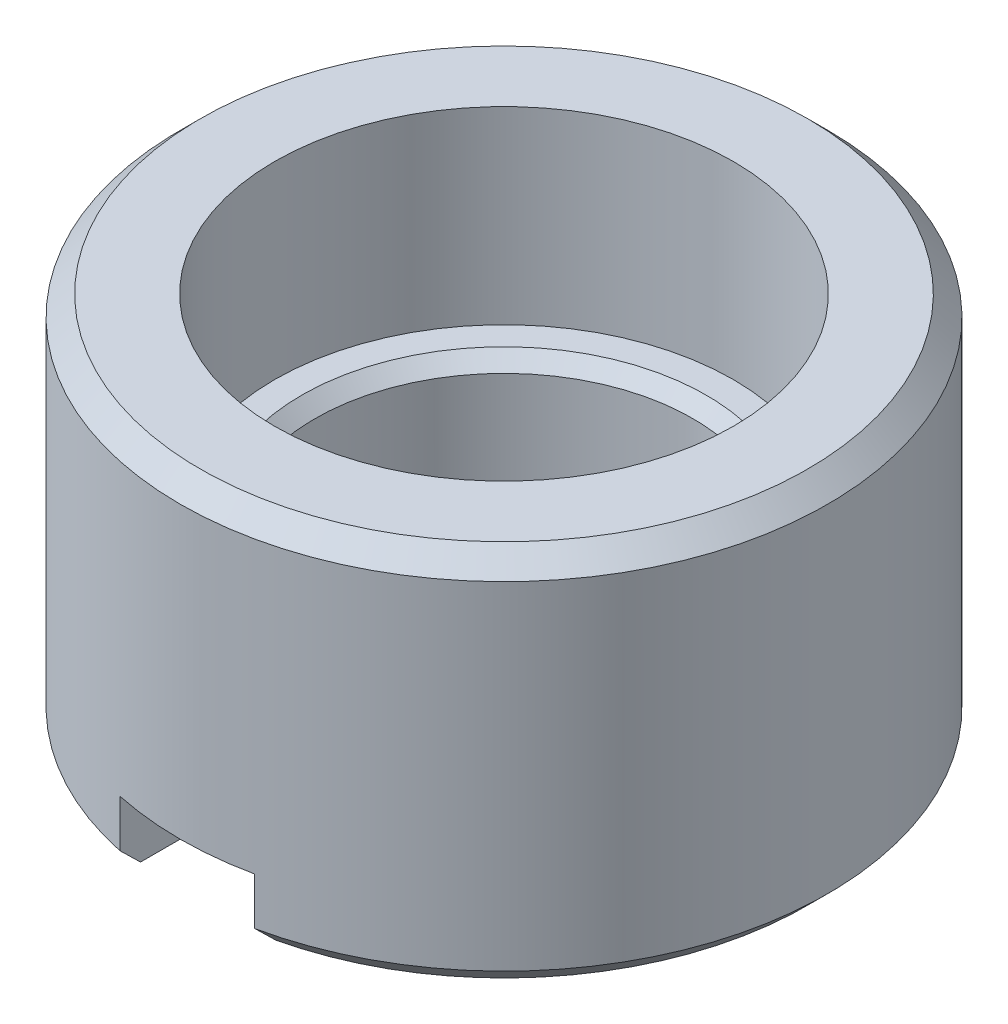
ISO-10303-21;
HEADER;
FILE_DESCRIPTION(('STEP AP214'),'2;1');
FILE_NAME('part.step','',(''),(''),'','','');
FILE_SCHEMA(('AUTOMOTIVE_DESIGN { 1 0 10303 214 1 1 1 1 }'));
ENDSEC;
DATA;
#1=APPLICATION_CONTEXT('core data for automotive mechanical design processes');
#2=APPLICATION_PROTOCOL_DEFINITION('international standard','automotive_design',2000,#1);
#3=PRODUCT_CONTEXT('',#1,'mechanical');
#4=PRODUCT('Part','Part','',(#3));
#5=PRODUCT_RELATED_PRODUCT_CATEGORY('part','',(#4));
#6=PRODUCT_DEFINITION_FORMATION('','',#4);
#7=PRODUCT_DEFINITION_CONTEXT('part definition',#1,'design');
#8=PRODUCT_DEFINITION('design','',#6,#7);
#9=PRODUCT_DEFINITION_SHAPE('','',#8);
#10=(LENGTH_UNIT() NAMED_UNIT(*) SI_UNIT(.MILLI.,.METRE.));
#11=(NAMED_UNIT(*) PLANE_ANGLE_UNIT() SI_UNIT($,.RADIAN.));
#12=(NAMED_UNIT(*) SI_UNIT($,.STERADIAN.) SOLID_ANGLE_UNIT());
#13=UNCERTAINTY_MEASURE_WITH_UNIT(LENGTH_MEASURE(1.E-05),#10,'distance_accuracy_value','');
#14=(GEOMETRIC_REPRESENTATION_CONTEXT(3) GLOBAL_UNCERTAINTY_ASSIGNED_CONTEXT((#13)) GLOBAL_UNIT_ASSIGNED_CONTEXT((#10,
#11,#12)) REPRESENTATION_CONTEXT('',''));
#15=CARTESIAN_POINT('',(0.,0.,0.));
#16=DIRECTION('',(0.,0.,1.));
#17=DIRECTION('',(1.,0.,0.));
#18=AXIS2_PLACEMENT_3D('',#15,#16,#17);
#19=CARTESIAN_POINT('',(0.,1.39999999993279,0.));
#20=DIRECTION('',(0.,1.,0.));
#21=DIRECTION('',(0.,0.,1.));
#22=AXIS2_PLACEMENT_3D('',#19,#20,#21);
#23=CONICAL_SURFACE('',#22,1.49999999996453,0.785398163397448);
#24=CARTESIAN_POINT('',(0.,1.39999999998963,0.));
#25=DIRECTION('',(0.,1.,0.));
#26=DIRECTION('',(0.,0.,1.));
#27=AXIS2_PLACEMENT_3D('',#24,#25,#26);
#28=CIRCLE('',#27,1.50000000002137);
#29=CARTESIAN_POINT('',(0.,1.39999999998963,1.50000000002137));
#30=VERTEX_POINT('',#29);
#31=EDGE_CURVE('E92',#30,#30,#28,.T.);
#32=ORIENTED_EDGE('',*,*,#31,.T.);
#33=EDGE_LOOP('',(#32));
#34=FACE_BOUND('',#33,.T.);
#35=CARTESIAN_POINT('',(0.,1.3,0.));
#36=DIRECTION('',(0.,1.,0.));
#37=DIRECTION('',(0.,0.,1.));
#38=AXIS2_PLACEMENT_3D('',#35,#36,#37);
#39=CIRCLE('',#38,1.4);
#40=CARTESIAN_POINT('',(0.,1.3,1.4));
#41=VERTEX_POINT('',#40);
#42=EDGE_CURVE('E89',#41,#41,#39,.F.);
#43=ORIENTED_EDGE('',*,*,#42,.T.);
#44=EDGE_LOOP('',(#43));
#45=FACE_BOUND('',#44,.T.);
#46=ADVANCED_FACE('F16',(#34,#45),#23,.F.);
#47=CARTESIAN_POINT('',(0.,0.,0.));
#48=DIRECTION('',(0.,1.,0.));
#49=DIRECTION('',(0.,0.,1.));
#50=AXIS2_PLACEMENT_3D('',#47,#48,#49);
#51=CYLINDRICAL_SURFACE('',#50,1.4);
#52=DIRECTION('',(0.,1.,0.));
#53=VECTOR('',#52,1.);
#54=CARTESIAN_POINT('',(-0.500000000000068,0.,1.30766968306218));
#55=LINE('',#54,#53);
#56=CARTESIAN_POINT('',(-0.500000000000034,0.149999999992563,1.30766968307487));
#57=VERTEX_POINT('',#56);
#58=CARTESIAN_POINT('',(-0.500000000000034,0.5,1.30766968306219));
#59=VERTEX_POINT('',#58);
#60=EDGE_CURVE('E65',#57,#59,#55,.T.);
#61=ORIENTED_EDGE('',*,*,#60,.F.);
#62=CARTESIAN_POINT('',(0.,0.149999999962347,0.));
#63=DIRECTION('',(0.,-1.,0.));
#64=DIRECTION('',(0.,0.,-1.));
#65=AXIS2_PLACEMENT_3D('',#62,#63,#64);
#66=CIRCLE('',#65,1.40000000004648);
#67=CARTESIAN_POINT('',(0.500000000000034,0.149999999996974,1.30766968307487));
#68=VERTEX_POINT('',#67);
#69=EDGE_CURVE('E88',#57,#68,#66,.T.);
#70=ORIENTED_EDGE('',*,*,#69,.T.);
#71=DIRECTION('',(0.,1.,0.));
#72=VECTOR('',#71,1.);
#73=CARTESIAN_POINT('',(0.500000000000068,0.,1.30766968306218));
#74=LINE('',#73,#72);
#75=CARTESIAN_POINT('',(0.500000000000034,0.5,1.30766968306219));
#76=VERTEX_POINT('',#75);
#77=EDGE_CURVE('E76',#76,#68,#74,.F.);
#78=ORIENTED_EDGE('',*,*,#77,.F.);
#79=CARTESIAN_POINT('',(0.,0.5,0.));
#80=DIRECTION('',(0.,1.,0.));
#81=DIRECTION('',(0.,0.,1.));
#82=AXIS2_PLACEMENT_3D('',#79,#80,#81);
#83=CIRCLE('',#82,1.4);
#84=EDGE_CURVE('E19',#59,#76,#83,.T.);
#85=ORIENTED_EDGE('',*,*,#84,.F.);
#86=EDGE_LOOP('',(#61,#70,#78,#85));
#87=FACE_BOUND('',#86,.T.);
#88=ORIENTED_EDGE('',*,*,#42,.F.);
#89=EDGE_LOOP('',(#88));
#90=FACE_BOUND('',#89,.T.);
#91=ADVANCED_FACE('F86',(#87,#90),#51,.F.);
#92=CARTESIAN_POINT('',(0.,1.4,0.));
#93=DIRECTION('',(0.,-1.,0.));
#94=DIRECTION('',(0.,0.,-1.));
#95=AXIS2_PLACEMENT_3D('',#92,#93,#94);
#96=PLANE('',#95);
#97=ORIENTED_EDGE('',*,*,#31,.F.);
#98=EDGE_LOOP('',(#97));
#99=FACE_BOUND('',#98,.T.);
#100=CARTESIAN_POINT('',(0.,1.4,0.));
#101=DIRECTION('',(0.,-1.,0.));
#102=DIRECTION('',(0.,0.,-1.));
#103=AXIS2_PLACEMENT_3D('',#100,#101,#102);
#104=CIRCLE('',#103,1.7);
#105=CARTESIAN_POINT('',(0.,1.4,-1.7));
#106=VERTEX_POINT('',#105);
#107=EDGE_CURVE('E150',#106,#106,#104,.F.);
#108=ORIENTED_EDGE('',*,*,#107,.T.);
#109=EDGE_LOOP('',(#108));
#110=FACE_BOUND('',#109,.T.);
#111=ADVANCED_FACE('F160',(#99,#110),#96,.F.);
#112=CARTESIAN_POINT('',(0.,5.6843418860808E-11,0.));
#113=DIRECTION('',(0.,-1.,0.));
#114=DIRECTION('',(0.,0.,-1.));
#115=AXIS2_PLACEMENT_3D('',#112,#113,#114);
#116=CONICAL_SURFACE('',#115,1.54999999995198,0.785398163397448);
#117=CARTESIAN_POINT('',(0.5,0.149999999985125,1.30766968308757));
#118=CARTESIAN_POINT('',(0.5,0.125087850502877,1.33433072209658));
#119=CARTESIAN_POINT('',(0.5,0.100131774020646,1.36095044277737));
#120=CARTESIAN_POINT('',(0.5,0.0501317740019223,1.41410724009827));
#121=CARTESIAN_POINT('',(0.5,0.0250878504898387,1.44064431676133));
#122=CARTESIAN_POINT('',(0.5,2.17968621792025E-12,1.46714007511914));
#123=B_SPLINE_CURVE_WITH_KNOTS('',3,(#117,#118,#119,#120,#121,#122),.UNSPECIFIED.,.F.,.F.,(4,2,
4),(0.,0.109465691166642,0.218931351920626),.UNSPECIFIED.);
#124=CARTESIAN_POINT('',(0.5,1.08985950878209E-12,1.46714007512029));
#125=VERTEX_POINT('',#124);
#126=EDGE_CURVE('E143',#68,#125,#123,.T.);
#127=ORIENTED_EDGE('',*,*,#126,.F.);
#128=ORIENTED_EDGE('',*,*,#69,.F.);
#129=CARTESIAN_POINT('',(-0.5,2.17949937497096E-12,1.46714007511914));
#130=CARTESIAN_POINT('',(-0.5,0.0250878504898384,1.44064431676133));
#131=CARTESIAN_POINT('',(-0.5,0.0501317740019221,1.41410724009827));
#132=CARTESIAN_POINT('',(-0.5,0.100131774020646,1.36095044277737));
#133=CARTESIAN_POINT('',(-0.5,0.125087850502877,1.33433072209658));
#134=CARTESIAN_POINT('',(-0.5,0.149999999985125,1.30766968308757));
#135=B_SPLINE_CURVE_WITH_KNOTS('',3,(#129,#130,#131,#132,#133,#134),.UNSPECIFIED.,.F.,.F.,(4,2,
4),(0.,0.109465660753984,0.218931351920626),.UNSPECIFIED.);
#136=CARTESIAN_POINT('',(-0.5,1.08975260971382E-12,1.46714007512029));
#137=VERTEX_POINT('',#136);
#138=EDGE_CURVE('E151',#137,#57,#135,.T.);
#139=ORIENTED_EDGE('',*,*,#138,.F.);
#140=CARTESIAN_POINT('',(0.,0.,0.));
#141=DIRECTION('',(0.,-1.,0.));
#142=DIRECTION('',(0.,0.,-1.));
#143=AXIS2_PLACEMENT_3D('',#140,#141,#142);
#144=CIRCLE('',#143,1.55000000000882);
#145=EDGE_CURVE('E196',#137,#125,#144,.T.);
#146=ORIENTED_EDGE('',*,*,#145,.T.);
#147=EDGE_LOOP('',(#127,#128,#139,#146));
#148=FACE_BOUND('',#147,.T.);
#149=ADVANCED_FACE('F155',(#148),#116,.F.);
#150=CARTESIAN_POINT('',(0.,2.8,0.));
#151=DIRECTION('',(0.,-1.,0.));
#152=DIRECTION('',(0.,0.,-1.));
#153=AXIS2_PLACEMENT_3D('',#150,#151,#152);
#154=CYLINDRICAL_SURFACE('',#153,1.7);
#155=CARTESIAN_POINT('',(0.,2.8,0.));
#156=DIRECTION('',(0.,-1.,0.));
#157=DIRECTION('',(0.,0.,-1.));
#158=AXIS2_PLACEMENT_3D('',#155,#156,#157);
#159=CIRCLE('',#158,1.7);
#160=CARTESIAN_POINT('',(0.,2.8,-1.7));
#161=VERTEX_POINT('',#160);
#162=EDGE_CURVE('E84',#161,#161,#159,.T.);
#163=ORIENTED_EDGE('',*,*,#162,.F.);
#164=EDGE_LOOP('',(#163));
#165=FACE_BOUND('',#164,.T.);
#166=ORIENTED_EDGE('',*,*,#107,.F.);
#167=EDGE_LOOP('',(#166));
#168=FACE_BOUND('',#167,.T.);
#169=ADVANCED_FACE('F159',(#165,#168),#154,.F.);
#170=CARTESIAN_POINT('',(0.,0.,0.));
#171=DIRECTION('',(0.,1.,0.));
#172=DIRECTION('',(0.,0.,1.));
#173=AXIS2_PLACEMENT_3D('',#170,#171,#172);
#174=PLANE('',#173);
#175=DIRECTION('',(0.,0.,1.));
#176=VECTOR('',#175,1.);
#177=CARTESIAN_POINT('',(-0.5,0.,3.));
#178=LINE('',#177,#176);
#179=CARTESIAN_POINT('',(-0.5,2.8421709430404E-11,2.19374109682261));
#180=VERTEX_POINT('',#179);
#181=EDGE_CURVE('E201',#137,#180,#178,.T.);
#182=ORIENTED_EDGE('',*,*,#181,.T.);
#183=CARTESIAN_POINT('',(0.,5.6843418860808E-11,0.));
#184=DIRECTION('',(0.,1.,0.));
#185=DIRECTION('',(0.,0.,1.));
#186=AXIS2_PLACEMENT_3D('',#183,#184,#185);
#187=CIRCLE('',#186,2.25000000000364);
#188=CARTESIAN_POINT('',(0.5,2.8421709430404E-11,2.19374109682261));
#189=VERTEX_POINT('',#188);
#190=EDGE_CURVE('E113',#189,#180,#187,.T.);
#191=ORIENTED_EDGE('',*,*,#190,.F.);
#192=DIRECTION('',(0.,0.,-1.));
#193=VECTOR('',#192,1.);
#194=CARTESIAN_POINT('',(0.5,0.,0.));
#195=LINE('',#194,#193);
#196=EDGE_CURVE('E198',#189,#125,#195,.T.);
#197=ORIENTED_EDGE('',*,*,#196,.T.);
#198=ORIENTED_EDGE('',*,*,#145,.F.);
#199=EDGE_LOOP('',(#182,#191,#197,#198));
#200=FACE_BOUND('',#199,.T.);
#201=ADVANCED_FACE('F139',(#200),#174,.F.);
#202=CARTESIAN_POINT('',(0.5,0.,0.));
#203=DIRECTION('',(1.,0.,0.));
#204=DIRECTION('',(0.,0.,-1.));
#205=AXIS2_PLACEMENT_3D('',#202,#203,#204);
#206=PLANE('',#205);
#207=DIRECTION('',(0.,1.,0.));
#208=VECTOR('',#207,1.);
#209=CARTESIAN_POINT('',(0.50000000000002,0.,2.3473389188611));
#210=LINE('',#209,#208);
#211=CARTESIAN_POINT('',(0.50000000000001,0.5,2.3473389188611));
#212=VERTEX_POINT('',#211);
#213=CARTESIAN_POINT('',(0.50000000000001,0.150000000011783,2.34733891884595));
#214=VERTEX_POINT('',#213);
#215=EDGE_CURVE('E83',#212,#214,#210,.F.);
#216=ORIENTED_EDGE('',*,*,#215,.F.);
#217=DIRECTION('',(0.,0.,-1.));
#218=VECTOR('',#217,1.);
#219=CARTESIAN_POINT('',(0.5,0.5,0.));
#220=LINE('',#219,#218);
#221=EDGE_CURVE('E72',#76,#212,#220,.F.);
#222=ORIENTED_EDGE('',*,*,#221,.F.);
#223=ORIENTED_EDGE('',*,*,#77,.T.);
#224=ORIENTED_EDGE('',*,*,#126,.T.);
#225=ORIENTED_EDGE('',*,*,#196,.F.);
#226=CARTESIAN_POINT('',(0.5,0.150000000023567,2.3473389188308));
#227=CARTESIAN_POINT('',(0.5,0.124979961149474,2.32175885157336));
#228=CARTESIAN_POINT('',(0.5,0.0999699417759317,2.29616899950868));
#229=CARTESIAN_POINT('',(0.5,0.049969941782863,2.24496972551179));
#230=CARTESIAN_POINT('',(0.5,0.0249799611635349,2.2193603035794));
#231=CARTESIAN_POINT('',(0.5,4.49548881446893E-11,2.19374109683957));
#232=B_SPLINE_CURVE_WITH_KNOTS('',3,(#226,#227,#228,#229,#230,#231),.UNSPECIFIED.,.F.,.F.,(4,2,
4),(0.,0.107345583885958,0.21469116883285),.UNSPECIFIED.);
#233=EDGE_CURVE('E129',#214,#189,#232,.T.);
#234=ORIENTED_EDGE('',*,*,#233,.F.);
#235=EDGE_LOOP('',(#216,#222,#223,#224,#225,#234));
#236=FACE_BOUND('',#235,.T.);
#237=ADVANCED_FACE('F79',(#236),#206,.F.);
#238=CARTESIAN_POINT('',(-0.5,0.,3.));
#239=DIRECTION('',(-1.,0.,0.));
#240=DIRECTION('',(0.,0.,1.));
#241=AXIS2_PLACEMENT_3D('',#238,#239,#240);
#242=PLANE('',#241);
#243=ORIENTED_EDGE('',*,*,#60,.T.);
#244=DIRECTION('',(0.,0.,-1.));
#245=VECTOR('',#244,1.);
#246=CARTESIAN_POINT('',(-0.5,0.5,0.));
#247=LINE('',#246,#245);
#248=CARTESIAN_POINT('',(-0.500000000000011,0.5,2.3473389188611));
#249=VERTEX_POINT('',#248);
#250=EDGE_CURVE('E34',#249,#59,#247,.T.);
#251=ORIENTED_EDGE('',*,*,#250,.F.);
#252=DIRECTION('',(0.,1.,0.));
#253=VECTOR('',#252,1.);
#254=CARTESIAN_POINT('',(-0.500000000000022,0.,2.3473389188611));
#255=LINE('',#254,#253);
#256=CARTESIAN_POINT('',(-0.500000000000011,0.150000000011783,2.34733891884595));
#257=VERTEX_POINT('',#256);
#258=EDGE_CURVE('E104',#257,#249,#255,.T.);
#259=ORIENTED_EDGE('',*,*,#258,.F.);
#260=CARTESIAN_POINT('',(-0.5,4.51335669472004E-11,2.19374109683975));
#261=CARTESIAN_POINT('',(-0.5,0.0249799611636839,2.21936030357955));
#262=CARTESIAN_POINT('',(-0.5,0.0499699417829821,2.24496972551191));
#263=CARTESIAN_POINT('',(-0.5,0.0999699417759912,2.29616899950874));
#264=CARTESIAN_POINT('',(-0.5,0.124979961149504,2.32175885157339));
#265=CARTESIAN_POINT('',(-0.5,0.150000000023567,2.3473389188308));
#266=B_SPLINE_CURVE_WITH_KNOTS('',3,(#260,#261,#262,#263,#264,#265),.UNSPECIFIED.,.F.,.F.,(4,2,
4),(0.,0.107345584946763,0.214691168832594),.UNSPECIFIED.);
#267=EDGE_CURVE('E105',#180,#257,#266,.T.);
#268=ORIENTED_EDGE('',*,*,#267,.F.);
#269=ORIENTED_EDGE('',*,*,#181,.F.);
#270=ORIENTED_EDGE('',*,*,#138,.T.);
#271=EDGE_LOOP('',(#243,#251,#259,#268,#269,#270));
#272=FACE_BOUND('',#271,.T.);
#273=ADVANCED_FACE('F115',(#272),#242,.F.);
#274=CARTESIAN_POINT('',(0.,0.5,0.));
#275=DIRECTION('',(0.,-1.,0.));
#276=DIRECTION('',(0.,0.,-1.));
#277=AXIS2_PLACEMENT_3D('',#274,#275,#276);
#278=PLANE('',#277);
#279=ORIENTED_EDGE('',*,*,#221,.T.);
#280=CARTESIAN_POINT('',(0.,0.5,0.));
#281=DIRECTION('',(0.,1.,0.));
#282=DIRECTION('',(0.,0.,1.));
#283=AXIS2_PLACEMENT_3D('',#280,#281,#282);
#284=CIRCLE('',#283,2.4);
#285=EDGE_CURVE('E102',#249,#212,#284,.T.);
#286=ORIENTED_EDGE('',*,*,#285,.F.);
#287=ORIENTED_EDGE('',*,*,#250,.T.);
#288=ORIENTED_EDGE('',*,*,#84,.T.);
#289=EDGE_LOOP('',(#279,#286,#287,#288));
#290=FACE_BOUND('',#289,.T.);
#291=ADVANCED_FACE('F71',(#290),#278,.T.);
#292=CARTESIAN_POINT('',(0.,2.8,0.));
#293=DIRECTION('',(0.,1.,0.));
#294=DIRECTION('',(0.,0.,1.));
#295=AXIS2_PLACEMENT_3D('',#292,#293,#294);
#296=PLANE('',#295);
#297=ORIENTED_EDGE('',*,*,#162,.T.);
#298=EDGE_LOOP('',(#297));
#299=FACE_BOUND('',#298,.T.);
#300=CARTESIAN_POINT('',(0.,2.79999999997926,0.));
#301=DIRECTION('',(0.,-1.,0.));
#302=DIRECTION('',(0.,0.,-1.));
#303=AXIS2_PLACEMENT_3D('',#300,#301,#302);
#304=CIRCLE('',#303,2.25000000000364);
#305=CARTESIAN_POINT('',(0.,2.79999999997926,-2.25000000000364));
#306=VERTEX_POINT('',#305);
#307=EDGE_CURVE('E99',#306,#306,#304,.T.);
#308=ORIENTED_EDGE('',*,*,#307,.F.);
#309=EDGE_LOOP('',(#308));
#310=FACE_BOUND('',#309,.T.);
#311=ADVANCED_FACE('F125',(#299,#310),#296,.T.);
#312=CARTESIAN_POINT('',(0.,0.149999999962347,0.));
#313=DIRECTION('',(0.,1.,0.));
#314=DIRECTION('',(0.,0.,1.));
#315=AXIS2_PLACEMENT_3D('',#312,#313,#314);
#316=CONICAL_SURFACE('',#315,2.39999999990914,0.785398163397448);
#317=ORIENTED_EDGE('',*,*,#267,.T.);
#318=CARTESIAN_POINT('',(0.,0.15,0.));
#319=DIRECTION('',(0.,1.,0.));
#320=DIRECTION('',(0.,0.,1.));
#321=AXIS2_PLACEMENT_3D('',#318,#319,#320);
#322=CIRCLE('',#321,2.4);
#323=EDGE_CURVE('E25',#214,#257,#322,.T.);
#324=ORIENTED_EDGE('',*,*,#323,.F.);
#325=ORIENTED_EDGE('',*,*,#233,.T.);
#326=ORIENTED_EDGE('',*,*,#190,.T.);
#327=EDGE_LOOP('',(#317,#324,#325,#326));
#328=FACE_BOUND('',#327,.T.);
#329=ADVANCED_FACE('F119',(#328),#316,.T.);
#330=CARTESIAN_POINT('',(0.,2.64999999996007,0.));
#331=DIRECTION('',(0.,-1.,0.));
#332=DIRECTION('',(0.,0.,-1.));
#333=AXIS2_PLACEMENT_3D('',#330,#331,#332);
#334=CONICAL_SURFACE('',#333,2.40000000002283,0.785398163397448);
#335=CARTESIAN_POINT('',(0.,2.65,0.));
#336=DIRECTION('',(0.,1.,0.));
#337=DIRECTION('',(0.,0.,1.));
#338=AXIS2_PLACEMENT_3D('',#335,#336,#337);
#339=CIRCLE('',#338,2.4);
#340=CARTESIAN_POINT('',(0.,2.65,2.4));
#341=VERTEX_POINT('',#340);
#342=EDGE_CURVE('E11',#341,#341,#339,.F.);
#343=ORIENTED_EDGE('',*,*,#342,.F.);
#344=EDGE_LOOP('',(#343));
#345=FACE_BOUND('',#344,.T.);
#346=ORIENTED_EDGE('',*,*,#307,.T.);
#347=EDGE_LOOP('',(#346));
#348=FACE_BOUND('',#347,.T.);
#349=ADVANCED_FACE('F124',(#345,#348),#334,.T.);
#350=CARTESIAN_POINT('',(0.,0.,0.));
#351=DIRECTION('',(0.,1.,0.));
#352=DIRECTION('',(0.,0.,1.));
#353=AXIS2_PLACEMENT_3D('',#350,#351,#352);
#354=CYLINDRICAL_SURFACE('',#353,2.4);
#355=ORIENTED_EDGE('',*,*,#215,.T.);
#356=ORIENTED_EDGE('',*,*,#323,.T.);
#357=ORIENTED_EDGE('',*,*,#258,.T.);
#358=ORIENTED_EDGE('',*,*,#285,.T.);
#359=EDGE_LOOP('',(#355,#356,#357,#358));
#360=FACE_BOUND('',#359,.T.);
#361=ORIENTED_EDGE('',*,*,#342,.T.);
#362=EDGE_LOOP('',(#361));
#363=FACE_BOUND('',#362,.T.);
#364=ADVANCED_FACE('F171',(#360,#363),#354,.T.);
#365=CLOSED_SHELL('',(#46,#91,#111,#149,#169,#201,#237,#273,#291,#311,#329,#349,#364));
#366=MANIFOLD_SOLID_BREP('B1',#365);
#367=ADVANCED_BREP_SHAPE_REPRESENTATION('',(#18,#366),#14);
#368=SHAPE_DEFINITION_REPRESENTATION(#9,#367);
ENDSEC;
END-ISO-10303-21;
